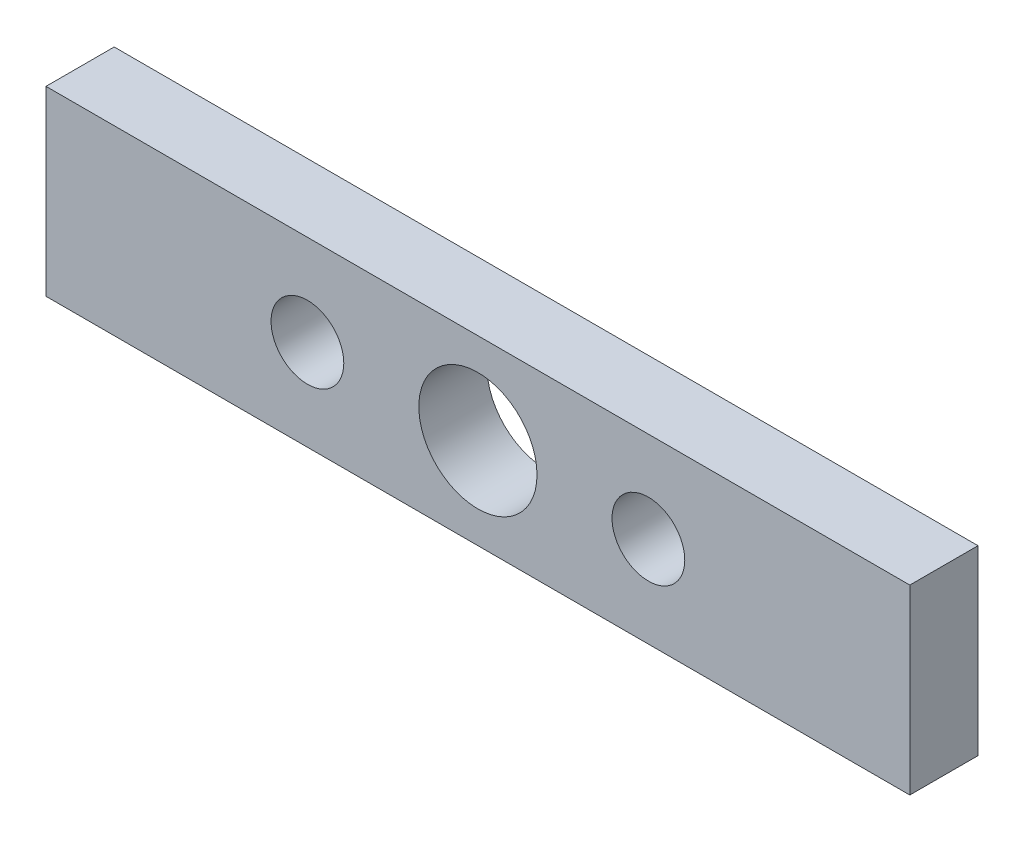
ISO-10303-21;
HEADER;
FILE_DESCRIPTION(('STEP AP214'),'2;1');
FILE_NAME('part.step','',(''),(''),'','','');
FILE_SCHEMA(('AUTOMOTIVE_DESIGN { 1 0 10303 214 1 1 1 1 }'));
ENDSEC;
DATA;
#1=APPLICATION_CONTEXT('core data for automotive mechanical design processes');
#2=APPLICATION_PROTOCOL_DEFINITION('international standard','automotive_design',2000,#1);
#3=PRODUCT_CONTEXT('',#1,'mechanical');
#4=PRODUCT('Part','Part','',(#3));
#5=PRODUCT_RELATED_PRODUCT_CATEGORY('part','',(#4));
#6=PRODUCT_DEFINITION_FORMATION('','',#4);
#7=PRODUCT_DEFINITION_CONTEXT('part definition',#1,'design');
#8=PRODUCT_DEFINITION('design','',#6,#7);
#9=PRODUCT_DEFINITION_SHAPE('','',#8);
#10=(LENGTH_UNIT() NAMED_UNIT(*) SI_UNIT(.MILLI.,.METRE.));
#11=(NAMED_UNIT(*) PLANE_ANGLE_UNIT() SI_UNIT($,.RADIAN.));
#12=(NAMED_UNIT(*) SI_UNIT($,.STERADIAN.) SOLID_ANGLE_UNIT());
#13=UNCERTAINTY_MEASURE_WITH_UNIT(LENGTH_MEASURE(1.E-05),#10,'distance_accuracy_value','');
#14=(GEOMETRIC_REPRESENTATION_CONTEXT(3) GLOBAL_UNCERTAINTY_ASSIGNED_CONTEXT((#13)) GLOBAL_UNIT_ASSIGNED_CONTEXT((#10,
#11,#12)) REPRESENTATION_CONTEXT('',''));
#15=CARTESIAN_POINT('',(0.,0.,0.));
#16=DIRECTION('',(0.,0.,1.));
#17=DIRECTION('',(1.,0.,0.));
#18=AXIS2_PLACEMENT_3D('',#15,#16,#17);
#19=CARTESIAN_POINT('',(0.,0.,3.));
#20=DIRECTION('',(0.,0.,1.));
#21=DIRECTION('',(1.,0.,0.));
#22=AXIS2_PLACEMENT_3D('',#19,#20,#21);
#23=PLANE('',#22);
#24=CARTESIAN_POINT('',(-7.5,0.,3.));
#25=DIRECTION('',(0.,0.,1.));
#26=DIRECTION('',(1.,0.,0.));
#27=AXIS2_PLACEMENT_3D('',#24,#25,#26);
#28=CIRCLE('',#27,1.6);
#29=CARTESIAN_POINT('',(-5.9,0.,3.));
#30=VERTEX_POINT('',#29);
#31=EDGE_CURVE('E116',#30,#30,#28,.T.);
#32=ORIENTED_EDGE('',*,*,#31,.F.);
#33=EDGE_LOOP('',(#32));
#34=FACE_BOUND('',#33,.T.);
#35=DIRECTION('',(0.,-1.,0.));
#36=VECTOR('',#35,1.);
#37=CARTESIAN_POINT('',(-19.,-4.,3.));
#38=LINE('',#37,#36);
#39=CARTESIAN_POINT('',(-19.,4.,3.));
#40=VERTEX_POINT('',#39);
#41=CARTESIAN_POINT('',(-19.,-4.,3.));
#42=VERTEX_POINT('',#41);
#43=EDGE_CURVE('E86',#40,#42,#38,.T.);
#44=ORIENTED_EDGE('',*,*,#43,.T.);
#45=DIRECTION('',(1.,0.,0.));
#46=VECTOR('',#45,1.);
#47=CARTESIAN_POINT('',(19.,-4.,3.));
#48=LINE('',#47,#46);
#49=CARTESIAN_POINT('',(19.,-4.,3.));
#50=VERTEX_POINT('',#49);
#51=EDGE_CURVE('E81',#42,#50,#48,.T.);
#52=ORIENTED_EDGE('',*,*,#51,.T.);
#53=DIRECTION('',(0.,1.,0.));
#54=VECTOR('',#53,1.);
#55=CARTESIAN_POINT('',(19.,-4.,3.));
#56=LINE('',#55,#54);
#57=CARTESIAN_POINT('',(19.,4.,3.));
#58=VERTEX_POINT('',#57);
#59=EDGE_CURVE('E84',#50,#58,#56,.T.);
#60=ORIENTED_EDGE('',*,*,#59,.T.);
#61=DIRECTION('',(-1.,0.,0.));
#62=VECTOR('',#61,1.);
#63=CARTESIAN_POINT('',(19.,4.,3.));
#64=LINE('',#63,#62);
#65=EDGE_CURVE('E51',#58,#40,#64,.T.);
#66=ORIENTED_EDGE('',*,*,#65,.T.);
#67=EDGE_LOOP('',(#44,#52,#60,#66));
#68=FACE_BOUND('',#67,.T.);
#69=CARTESIAN_POINT('',(0.,0.,3.));
#70=DIRECTION('',(0.,0.,1.));
#71=DIRECTION('',(1.,0.,0.));
#72=AXIS2_PLACEMENT_3D('',#69,#70,#71);
#73=CIRCLE('',#72,2.6);
#74=CARTESIAN_POINT('',(2.6,0.,3.));
#75=VERTEX_POINT('',#74);
#76=EDGE_CURVE('E101',#75,#75,#73,.T.);
#77=ORIENTED_EDGE('',*,*,#76,.F.);
#78=EDGE_LOOP('',(#77));
#79=FACE_BOUND('',#78,.T.);
#80=CARTESIAN_POINT('',(7.5,0.,3.));
#81=DIRECTION('',(0.,0.,1.));
#82=DIRECTION('',(1.,0.,0.));
#83=AXIS2_PLACEMENT_3D('',#80,#81,#82);
#84=CIRCLE('',#83,1.6);
#85=CARTESIAN_POINT('',(9.1,0.,3.));
#86=VERTEX_POINT('',#85);
#87=EDGE_CURVE('E122',#86,#86,#84,.T.);
#88=ORIENTED_EDGE('',*,*,#87,.F.);
#89=EDGE_LOOP('',(#88));
#90=FACE_BOUND('',#89,.T.);
#91=ADVANCED_FACE('F34',(#34,#68,#79,#90),#23,.T.);
#92=CARTESIAN_POINT('',(0.,0.,0.));
#93=DIRECTION('',(0.,0.,1.));
#94=DIRECTION('',(1.,0.,0.));
#95=AXIS2_PLACEMENT_3D('',#92,#93,#94);
#96=PLANE('',#95);
#97=CARTESIAN_POINT('',(-7.5,0.,0.));
#98=DIRECTION('',(0.,0.,1.));
#99=DIRECTION('',(1.,0.,0.));
#100=AXIS2_PLACEMENT_3D('',#97,#98,#99);
#101=CIRCLE('',#100,1.6);
#102=CARTESIAN_POINT('',(-5.9,0.,0.));
#103=VERTEX_POINT('',#102);
#104=EDGE_CURVE('E119',#103,#103,#101,.T.);
#105=ORIENTED_EDGE('',*,*,#104,.T.);
#106=EDGE_LOOP('',(#105));
#107=FACE_BOUND('',#106,.T.);
#108=DIRECTION('',(0.,-1.,0.));
#109=VECTOR('',#108,1.);
#110=CARTESIAN_POINT('',(-19.,-4.,0.));
#111=LINE('',#110,#109);
#112=CARTESIAN_POINT('',(-19.,4.,0.));
#113=VERTEX_POINT('',#112);
#114=CARTESIAN_POINT('',(-19.,-4.,0.));
#115=VERTEX_POINT('',#114);
#116=EDGE_CURVE('E98',#113,#115,#111,.T.);
#117=ORIENTED_EDGE('',*,*,#116,.F.);
#118=DIRECTION('',(-1.,0.,0.));
#119=VECTOR('',#118,1.);
#120=CARTESIAN_POINT('',(19.,4.,0.));
#121=LINE('',#120,#119);
#122=CARTESIAN_POINT('',(19.,4.,0.));
#123=VERTEX_POINT('',#122);
#124=EDGE_CURVE('E74',#123,#113,#121,.T.);
#125=ORIENTED_EDGE('',*,*,#124,.F.);
#126=DIRECTION('',(0.,1.,0.));
#127=VECTOR('',#126,1.);
#128=CARTESIAN_POINT('',(19.,-4.,0.));
#129=LINE('',#128,#127);
#130=CARTESIAN_POINT('',(19.,-4.,0.));
#131=VERTEX_POINT('',#130);
#132=EDGE_CURVE('E68',#131,#123,#129,.T.);
#133=ORIENTED_EDGE('',*,*,#132,.F.);
#134=DIRECTION('',(1.,0.,0.));
#135=VECTOR('',#134,1.);
#136=CARTESIAN_POINT('',(19.,-4.,0.));
#137=LINE('',#136,#135);
#138=EDGE_CURVE('E90',#115,#131,#137,.T.);
#139=ORIENTED_EDGE('',*,*,#138,.F.);
#140=EDGE_LOOP('',(#117,#125,#133,#139));
#141=FACE_BOUND('',#140,.T.);
#142=CARTESIAN_POINT('',(0.,0.,0.));
#143=DIRECTION('',(0.,0.,1.));
#144=DIRECTION('',(1.,0.,0.));
#145=AXIS2_PLACEMENT_3D('',#142,#143,#144);
#146=CIRCLE('',#145,2.6);
#147=CARTESIAN_POINT('',(2.6,0.,0.));
#148=VERTEX_POINT('',#147);
#149=EDGE_CURVE('E113',#148,#148,#146,.T.);
#150=ORIENTED_EDGE('',*,*,#149,.T.);
#151=EDGE_LOOP('',(#150));
#152=FACE_BOUND('',#151,.T.);
#153=CARTESIAN_POINT('',(7.5,0.,0.));
#154=DIRECTION('',(0.,0.,1.));
#155=DIRECTION('',(1.,0.,0.));
#156=AXIS2_PLACEMENT_3D('',#153,#154,#155);
#157=CIRCLE('',#156,1.6);
#158=CARTESIAN_POINT('',(9.1,0.,0.));
#159=VERTEX_POINT('',#158);
#160=EDGE_CURVE('E125',#159,#159,#157,.T.);
#161=ORIENTED_EDGE('',*,*,#160,.T.);
#162=EDGE_LOOP('',(#161));
#163=FACE_BOUND('',#162,.T.);
#164=ADVANCED_FACE('F109',(#107,#141,#152,#163),#96,.F.);
#165=CARTESIAN_POINT('',(-19.,-4.,3.));
#166=DIRECTION('',(1.,0.,0.));
#167=DIRECTION('',(0.,0.,-1.));
#168=AXIS2_PLACEMENT_3D('',#165,#166,#167);
#169=PLANE('',#168);
#170=ORIENTED_EDGE('',*,*,#116,.T.);
#171=DIRECTION('',(0.,0.,-1.));
#172=VECTOR('',#171,1.);
#173=CARTESIAN_POINT('',(-19.,-4.,3.));
#174=LINE('',#173,#172);
#175=EDGE_CURVE('E11',#42,#115,#174,.T.);
#176=ORIENTED_EDGE('',*,*,#175,.F.);
#177=ORIENTED_EDGE('',*,*,#43,.F.);
#178=DIRECTION('',(0.,0.,-1.));
#179=VECTOR('',#178,1.);
#180=CARTESIAN_POINT('',(-19.,4.,3.));
#181=LINE('',#180,#179);
#182=EDGE_CURVE('E94',#40,#113,#181,.T.);
#183=ORIENTED_EDGE('',*,*,#182,.T.);
#184=EDGE_LOOP('',(#170,#176,#177,#183));
#185=FACE_BOUND('',#184,.T.);
#186=ADVANCED_FACE('F36',(#185),#169,.F.);
#187=CARTESIAN_POINT('',(19.,-4.,3.));
#188=DIRECTION('',(0.,1.,0.));
#189=DIRECTION('',(-1.,0.,0.));
#190=AXIS2_PLACEMENT_3D('',#187,#188,#189);
#191=PLANE('',#190);
#192=ORIENTED_EDGE('',*,*,#138,.T.);
#193=DIRECTION('',(0.,0.,-1.));
#194=VECTOR('',#193,1.);
#195=CARTESIAN_POINT('',(19.,-4.,3.));
#196=LINE('',#195,#194);
#197=EDGE_CURVE('E43',#50,#131,#196,.T.);
#198=ORIENTED_EDGE('',*,*,#197,.F.);
#199=ORIENTED_EDGE('',*,*,#51,.F.);
#200=ORIENTED_EDGE('',*,*,#175,.T.);
#201=EDGE_LOOP('',(#192,#198,#199,#200));
#202=FACE_BOUND('',#201,.T.);
#203=ADVANCED_FACE('F89',(#202),#191,.F.);
#204=CARTESIAN_POINT('',(19.,-4.,3.));
#205=DIRECTION('',(-1.,0.,0.));
#206=DIRECTION('',(0.,0.,1.));
#207=AXIS2_PLACEMENT_3D('',#204,#205,#206);
#208=PLANE('',#207);
#209=ORIENTED_EDGE('',*,*,#132,.T.);
#210=DIRECTION('',(0.,0.,-1.));
#211=VECTOR('',#210,1.);
#212=CARTESIAN_POINT('',(19.,4.,3.));
#213=LINE('',#212,#211);
#214=EDGE_CURVE('E91',#58,#123,#213,.T.);
#215=ORIENTED_EDGE('',*,*,#214,.F.);
#216=ORIENTED_EDGE('',*,*,#59,.F.);
#217=ORIENTED_EDGE('',*,*,#197,.T.);
#218=EDGE_LOOP('',(#209,#215,#216,#217));
#219=FACE_BOUND('',#218,.T.);
#220=ADVANCED_FACE('F92',(#219),#208,.F.);
#221=CARTESIAN_POINT('',(19.,4.,3.));
#222=DIRECTION('',(0.,-1.,0.));
#223=DIRECTION('',(1.,0.,0.));
#224=AXIS2_PLACEMENT_3D('',#221,#222,#223);
#225=PLANE('',#224);
#226=ORIENTED_EDGE('',*,*,#124,.T.);
#227=ORIENTED_EDGE('',*,*,#182,.F.);
#228=ORIENTED_EDGE('',*,*,#65,.F.);
#229=ORIENTED_EDGE('',*,*,#214,.T.);
#230=EDGE_LOOP('',(#226,#227,#228,#229));
#231=FACE_BOUND('',#230,.T.);
#232=ADVANCED_FACE('F106',(#231),#225,.F.);
#233=CARTESIAN_POINT('',(0.,0.,3.));
#234=DIRECTION('',(0.,0.,-1.));
#235=DIRECTION('',(-1.,0.,0.));
#236=AXIS2_PLACEMENT_3D('',#233,#234,#235);
#237=CYLINDRICAL_SURFACE('',#236,2.6);
#238=ORIENTED_EDGE('',*,*,#76,.T.);
#239=EDGE_LOOP('',(#238));
#240=FACE_BOUND('',#239,.T.);
#241=ORIENTED_EDGE('',*,*,#149,.F.);
#242=EDGE_LOOP('',(#241));
#243=FACE_BOUND('',#242,.T.);
#244=ADVANCED_FACE('F144',(#240,#243),#237,.F.);
#245=CARTESIAN_POINT('',(-7.5,0.,3.));
#246=DIRECTION('',(0.,0.,-1.));
#247=DIRECTION('',(-1.,0.,0.));
#248=AXIS2_PLACEMENT_3D('',#245,#246,#247);
#249=CYLINDRICAL_SURFACE('',#248,1.6);
#250=ORIENTED_EDGE('',*,*,#31,.T.);
#251=EDGE_LOOP('',(#250));
#252=FACE_BOUND('',#251,.T.);
#253=ORIENTED_EDGE('',*,*,#104,.F.);
#254=EDGE_LOOP('',(#253));
#255=FACE_BOUND('',#254,.T.);
#256=ADVANCED_FACE('F190',(#252,#255),#249,.F.);
#257=CARTESIAN_POINT('',(7.5,0.,3.));
#258=DIRECTION('',(0.,0.,-1.));
#259=DIRECTION('',(-1.,0.,0.));
#260=AXIS2_PLACEMENT_3D('',#257,#258,#259);
#261=CYLINDRICAL_SURFACE('',#260,1.6);
#262=ORIENTED_EDGE('',*,*,#87,.T.);
#263=EDGE_LOOP('',(#262));
#264=FACE_BOUND('',#263,.T.);
#265=ORIENTED_EDGE('',*,*,#160,.F.);
#266=EDGE_LOOP('',(#265));
#267=FACE_BOUND('',#266,.T.);
#268=ADVANCED_FACE('F131',(#264,#267),#261,.F.);
#269=CLOSED_SHELL('',(#91,#164,#186,#203,#220,#232,#244,#256,#268));
#270=MANIFOLD_SOLID_BREP('B2',#269);
#271=ADVANCED_BREP_SHAPE_REPRESENTATION('',(#18,#270),#14);
#272=SHAPE_DEFINITION_REPRESENTATION(#9,#271);
ENDSEC;
END-ISO-10303-21;
